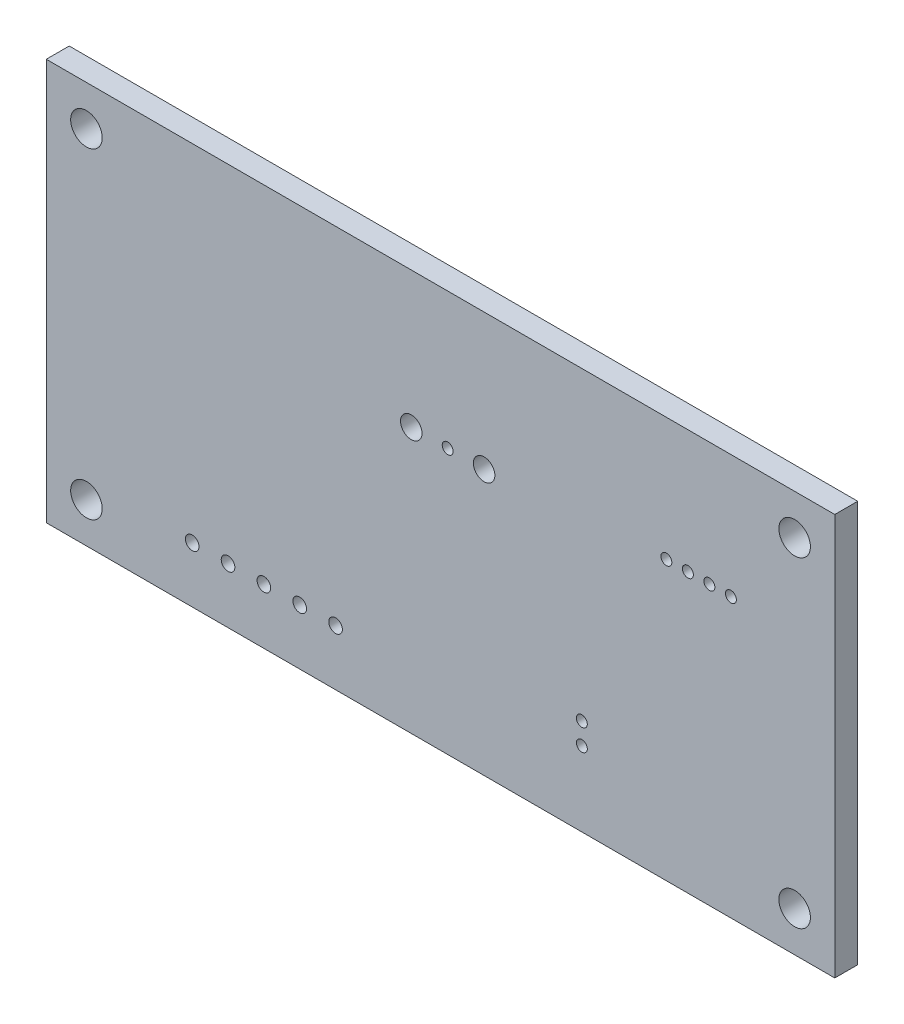
ISO-10303-21;
HEADER;
FILE_DESCRIPTION(('STEP AP214'),'2;1');
FILE_NAME('part.step','',(''),(''),'','','');
FILE_SCHEMA(('AUTOMOTIVE_DESIGN { 1 0 10303 214 1 1 1 1 }'));
ENDSEC;
DATA;
#1=APPLICATION_CONTEXT('core data for automotive mechanical design processes');
#2=APPLICATION_PROTOCOL_DEFINITION('international standard','automotive_design',2000,#1);
#3=PRODUCT_CONTEXT('',#1,'mechanical');
#4=PRODUCT('Part','Part','',(#3));
#5=PRODUCT_RELATED_PRODUCT_CATEGORY('part','',(#4));
#6=PRODUCT_DEFINITION_FORMATION('','',#4);
#7=PRODUCT_DEFINITION_CONTEXT('part definition',#1,'design');
#8=PRODUCT_DEFINITION('design','',#6,#7);
#9=PRODUCT_DEFINITION_SHAPE('','',#8);
#10=(LENGTH_UNIT() NAMED_UNIT(*) SI_UNIT(.MILLI.,.METRE.));
#11=(NAMED_UNIT(*) PLANE_ANGLE_UNIT() SI_UNIT($,.RADIAN.));
#12=(NAMED_UNIT(*) SI_UNIT($,.STERADIAN.) SOLID_ANGLE_UNIT());
#13=UNCERTAINTY_MEASURE_WITH_UNIT(LENGTH_MEASURE(1.E-05),#10,'distance_accuracy_value','');
#14=(GEOMETRIC_REPRESENTATION_CONTEXT(3) GLOBAL_UNCERTAINTY_ASSIGNED_CONTEXT((#13)) GLOBAL_UNIT_ASSIGNED_CONTEXT((#10,
#11,#12)) REPRESENTATION_CONTEXT('',''));
#15=CARTESIAN_POINT('',(0.,0.,0.));
#16=DIRECTION('',(0.,0.,1.));
#17=DIRECTION('',(1.,0.,0.));
#18=AXIS2_PLACEMENT_3D('',#15,#16,#17);
#19=CARTESIAN_POINT('',(64.754,-24.082,-0.8));
#20=DIRECTION('',(0.,0.,1.));
#21=DIRECTION('',(1.,0.,0.));
#22=AXIS2_PLACEMENT_3D('',#19,#20,#21);
#23=CYLINDRICAL_SURFACE('',#22,0.381);
#24=DIRECTION('',(0.,0.,1.));
#25=VECTOR('',#24,1.);
#26=CARTESIAN_POINT('',(65.135,-24.082,-0.8));
#27=LINE('',#26,#25);
#28=CARTESIAN_POINT('',(65.135,-24.082,0.));
#29=VERTEX_POINT('',#28);
#30=CARTESIAN_POINT('',(65.135,-24.082,1.6));
#31=VERTEX_POINT('',#30);
#32=EDGE_CURVE('E11',#29,#31,#27,.T.);
#33=ORIENTED_EDGE('',*,*,#32,.F.);
#34=CARTESIAN_POINT('',(64.754,-24.082,0.));
#35=DIRECTION('',(0.,0.,1.));
#36=DIRECTION('',(1.,0.,0.));
#37=AXIS2_PLACEMENT_3D('',#34,#35,#36);
#38=CIRCLE('',#37,0.381);
#39=EDGE_CURVE('E233',#29,#29,#38,.T.);
#40=ORIENTED_EDGE('',*,*,#39,.F.);
#41=ORIENTED_EDGE('',*,*,#32,.T.);
#42=CARTESIAN_POINT('',(64.754,-24.082,1.6));
#43=DIRECTION('',(0.,0.,1.));
#44=DIRECTION('',(1.,0.,0.));
#45=AXIS2_PLACEMENT_3D('',#42,#43,#44);
#46=CIRCLE('',#45,0.381);
#47=EDGE_CURVE('E343',#31,#31,#46,.T.);
#48=ORIENTED_EDGE('',*,*,#47,.T.);
#49=EDGE_LOOP('',(#33,#40,#41,#48));
#50=FACE_BOUND('',#49,.T.);
#51=ADVANCED_FACE('F17',(#50),#23,.F.);
#52=CARTESIAN_POINT('',(69.2,-40.7,-0.8));
#53=DIRECTION('',(0.,0.,1.));
#54=DIRECTION('',(1.,0.,0.));
#55=AXIS2_PLACEMENT_3D('',#52,#53,#54);
#56=CYLINDRICAL_SURFACE('',#55,1.1);
#57=DIRECTION('',(0.,0.,1.));
#58=VECTOR('',#57,1.);
#59=CARTESIAN_POINT('',(70.3,-40.7,-0.8));
#60=LINE('',#59,#58);
#61=CARTESIAN_POINT('',(70.3,-40.7,0.));
#62=VERTEX_POINT('',#61);
#63=CARTESIAN_POINT('',(70.3,-40.7,1.6));
#64=VERTEX_POINT('',#63);
#65=EDGE_CURVE('E28',#62,#64,#60,.T.);
#66=ORIENTED_EDGE('',*,*,#65,.F.);
#67=CARTESIAN_POINT('',(69.2,-40.7,0.));
#68=DIRECTION('',(0.,0.,1.));
#69=DIRECTION('',(1.,0.,0.));
#70=AXIS2_PLACEMENT_3D('',#67,#68,#69);
#71=CIRCLE('',#70,1.1);
#72=EDGE_CURVE('E269',#62,#62,#71,.T.);
#73=ORIENTED_EDGE('',*,*,#72,.F.);
#74=ORIENTED_EDGE('',*,*,#65,.T.);
#75=CARTESIAN_POINT('',(69.2,-40.7,1.6));
#76=DIRECTION('',(0.,0.,1.));
#77=DIRECTION('',(1.,0.,0.));
#78=AXIS2_PLACEMENT_3D('',#75,#76,#77);
#79=CIRCLE('',#78,1.1);
#80=EDGE_CURVE('E274',#64,#64,#79,.T.);
#81=ORIENTED_EDGE('',*,*,#80,.T.);
#82=EDGE_LOOP('',(#66,#73,#74,#81));
#83=FACE_BOUND('',#82,.T.);
#84=ADVANCED_FACE('F493',(#83),#56,.F.);
#85=CARTESIAN_POINT('',(69.2,-18.3,-0.8));
#86=DIRECTION('',(0.,0.,1.));
#87=DIRECTION('',(1.,0.,0.));
#88=AXIS2_PLACEMENT_3D('',#85,#86,#87);
#89=CYLINDRICAL_SURFACE('',#88,1.1);
#90=DIRECTION('',(0.,0.,1.));
#91=VECTOR('',#90,1.);
#92=CARTESIAN_POINT('',(70.3,-18.3,-0.8));
#93=LINE('',#92,#91);
#94=CARTESIAN_POINT('',(70.3,-18.3,0.));
#95=VERTEX_POINT('',#94);
#96=CARTESIAN_POINT('',(70.3,-18.3,1.6));
#97=VERTEX_POINT('',#96);
#98=EDGE_CURVE('E280',#95,#97,#93,.T.);
#99=ORIENTED_EDGE('',*,*,#98,.F.);
#100=CARTESIAN_POINT('',(69.2,-18.3,0.));
#101=DIRECTION('',(0.,0.,1.));
#102=DIRECTION('',(1.,0.,0.));
#103=AXIS2_PLACEMENT_3D('',#100,#101,#102);
#104=CIRCLE('',#103,1.1);
#105=EDGE_CURVE('E265',#95,#95,#104,.T.);
#106=ORIENTED_EDGE('',*,*,#105,.F.);
#107=ORIENTED_EDGE('',*,*,#98,.T.);
#108=CARTESIAN_POINT('',(69.2,-18.3,1.6));
#109=DIRECTION('',(0.,0.,1.));
#110=DIRECTION('',(1.,0.,0.));
#111=AXIS2_PLACEMENT_3D('',#108,#109,#110);
#112=CIRCLE('',#111,1.1);
#113=EDGE_CURVE('E401',#97,#97,#112,.T.);
#114=ORIENTED_EDGE('',*,*,#113,.T.);
#115=EDGE_LOOP('',(#99,#106,#107,#114));
#116=FACE_BOUND('',#115,.T.);
#117=ADVANCED_FACE('F499',(#116),#89,.F.);
#118=CARTESIAN_POINT('',(54.356,-38.298,-0.8));
#119=DIRECTION('',(0.,0.,1.));
#120=DIRECTION('',(1.,0.,0.));
#121=AXIS2_PLACEMENT_3D('',#118,#119,#120);
#122=CYLINDRICAL_SURFACE('',#121,0.381);
#123=DIRECTION('',(0.,0.,1.));
#124=VECTOR('',#123,1.);
#125=CARTESIAN_POINT('',(54.737,-38.298,-0.8));
#126=LINE('',#125,#124);
#127=CARTESIAN_POINT('',(54.737,-38.298,0.));
#128=VERTEX_POINT('',#127);
#129=CARTESIAN_POINT('',(54.737,-38.298,1.6));
#130=VERTEX_POINT('',#129);
#131=EDGE_CURVE('E248',#128,#130,#126,.T.);
#132=ORIENTED_EDGE('',*,*,#131,.F.);
#133=CARTESIAN_POINT('',(54.356,-38.298,0.));
#134=DIRECTION('',(0.,0.,1.));
#135=DIRECTION('',(1.,0.,0.));
#136=AXIS2_PLACEMENT_3D('',#133,#134,#135);
#137=CIRCLE('',#136,0.381);
#138=EDGE_CURVE('E270',#128,#128,#137,.T.);
#139=ORIENTED_EDGE('',*,*,#138,.F.);
#140=ORIENTED_EDGE('',*,*,#131,.T.);
#141=CARTESIAN_POINT('',(54.356,-38.298,1.6));
#142=DIRECTION('',(0.,0.,1.));
#143=DIRECTION('',(1.,0.,0.));
#144=AXIS2_PLACEMENT_3D('',#141,#142,#143);
#145=CIRCLE('',#144,0.381);
#146=EDGE_CURVE('E410',#130,#130,#145,.T.);
#147=ORIENTED_EDGE('',*,*,#146,.T.);
#148=EDGE_LOOP('',(#132,#139,#140,#147));
#149=FACE_BOUND('',#148,.T.);
#150=ADVANCED_FACE('F463',(#149),#122,.F.);
#151=CARTESIAN_POINT('',(54.356,-36.798,-0.8));
#152=DIRECTION('',(0.,0.,1.));
#153=DIRECTION('',(1.,0.,0.));
#154=AXIS2_PLACEMENT_3D('',#151,#152,#153);
#155=CYLINDRICAL_SURFACE('',#154,0.381);
#156=DIRECTION('',(0.,0.,1.));
#157=VECTOR('',#156,1.);
#158=CARTESIAN_POINT('',(54.737,-36.798,-0.8));
#159=LINE('',#158,#157);
#160=CARTESIAN_POINT('',(54.737,-36.798,0.));
#161=VERTEX_POINT('',#160);
#162=CARTESIAN_POINT('',(54.737,-36.798,1.6));
#163=VERTEX_POINT('',#162);
#164=EDGE_CURVE('E215',#161,#163,#159,.T.);
#165=ORIENTED_EDGE('',*,*,#164,.F.);
#166=CARTESIAN_POINT('',(54.356,-36.798,0.));
#167=DIRECTION('',(0.,0.,1.));
#168=DIRECTION('',(1.,0.,0.));
#169=AXIS2_PLACEMENT_3D('',#166,#167,#168);
#170=CIRCLE('',#169,0.381);
#171=EDGE_CURVE('E347',#161,#161,#170,.T.);
#172=ORIENTED_EDGE('',*,*,#171,.F.);
#173=ORIENTED_EDGE('',*,*,#164,.T.);
#174=CARTESIAN_POINT('',(54.356,-36.798,1.6));
#175=DIRECTION('',(0.,0.,1.));
#176=DIRECTION('',(1.,0.,0.));
#177=AXIS2_PLACEMENT_3D('',#174,#175,#176);
#178=CIRCLE('',#177,0.381);
#179=EDGE_CURVE('E278',#163,#163,#178,.T.);
#180=ORIENTED_EDGE('',*,*,#179,.T.);
#181=EDGE_LOOP('',(#165,#172,#173,#180));
#182=FACE_BOUND('',#181,.T.);
#183=ADVANCED_FACE('F580',(#182),#155,.F.);
#184=CARTESIAN_POINT('',(34.678,-39.624,-0.8));
#185=DIRECTION('',(0.,0.,1.));
#186=DIRECTION('',(1.,0.,0.));
#187=AXIS2_PLACEMENT_3D('',#184,#185,#186);
#188=CYLINDRICAL_SURFACE('',#187,0.475);
#189=DIRECTION('',(0.,0.,1.));
#190=VECTOR('',#189,1.);
#191=CARTESIAN_POINT('',(35.153,-39.624,-0.8));
#192=LINE('',#191,#190);
#193=CARTESIAN_POINT('',(35.153,-39.624,0.));
#194=VERTEX_POINT('',#193);
#195=CARTESIAN_POINT('',(35.153,-39.624,1.6));
#196=VERTEX_POINT('',#195);
#197=EDGE_CURVE('E211',#194,#196,#192,.T.);
#198=ORIENTED_EDGE('',*,*,#197,.F.);
#199=CARTESIAN_POINT('',(34.678,-39.624,0.));
#200=DIRECTION('',(0.,0.,1.));
#201=DIRECTION('',(1.,0.,0.));
#202=AXIS2_PLACEMENT_3D('',#199,#200,#201);
#203=CIRCLE('',#202,0.475);
#204=EDGE_CURVE('E227',#194,#194,#203,.T.);
#205=ORIENTED_EDGE('',*,*,#204,.F.);
#206=ORIENTED_EDGE('',*,*,#197,.T.);
#207=CARTESIAN_POINT('',(34.678,-39.624,1.6));
#208=DIRECTION('',(0.,0.,1.));
#209=DIRECTION('',(1.,0.,0.));
#210=AXIS2_PLACEMENT_3D('',#207,#208,#209);
#211=CIRCLE('',#210,0.475);
#212=EDGE_CURVE('E293',#196,#196,#211,.T.);
#213=ORIENTED_EDGE('',*,*,#212,.T.);
#214=EDGE_LOOP('',(#198,#205,#206,#213));
#215=FACE_BOUND('',#214,.T.);
#216=ADVANCED_FACE('F503',(#215),#188,.F.);
#217=CARTESIAN_POINT('',(37.178,-39.624,-0.8));
#218=DIRECTION('',(0.,0.,1.));
#219=DIRECTION('',(1.,0.,0.));
#220=AXIS2_PLACEMENT_3D('',#217,#218,#219);
#221=CYLINDRICAL_SURFACE('',#220,0.475);
#222=DIRECTION('',(0.,0.,1.));
#223=VECTOR('',#222,1.);
#224=CARTESIAN_POINT('',(37.653,-39.624,-0.8));
#225=LINE('',#224,#223);
#226=CARTESIAN_POINT('',(37.653,-39.624,0.));
#227=VERTEX_POINT('',#226);
#228=CARTESIAN_POINT('',(37.653,-39.624,1.6));
#229=VERTEX_POINT('',#228);
#230=EDGE_CURVE('E216',#227,#229,#225,.T.);
#231=ORIENTED_EDGE('',*,*,#230,.F.);
#232=CARTESIAN_POINT('',(37.178,-39.624,0.));
#233=DIRECTION('',(0.,0.,1.));
#234=DIRECTION('',(1.,0.,0.));
#235=AXIS2_PLACEMENT_3D('',#232,#233,#234);
#236=CIRCLE('',#235,0.475);
#237=EDGE_CURVE('E223',#227,#227,#236,.T.);
#238=ORIENTED_EDGE('',*,*,#237,.F.);
#239=ORIENTED_EDGE('',*,*,#230,.T.);
#240=CARTESIAN_POINT('',(37.178,-39.624,1.6));
#241=DIRECTION('',(0.,0.,1.));
#242=DIRECTION('',(1.,0.,0.));
#243=AXIS2_PLACEMENT_3D('',#240,#241,#242);
#244=CIRCLE('',#243,0.475);
#245=EDGE_CURVE('E210',#229,#229,#244,.T.);
#246=ORIENTED_EDGE('',*,*,#245,.T.);
#247=EDGE_LOOP('',(#231,#238,#239,#246));
#248=FACE_BOUND('',#247,.T.);
#249=ADVANCED_FACE('F602',(#248),#221,.F.);
#250=CARTESIAN_POINT('',(32.178,-39.624,-0.8));
#251=DIRECTION('',(0.,0.,1.));
#252=DIRECTION('',(1.,0.,0.));
#253=AXIS2_PLACEMENT_3D('',#250,#251,#252);
#254=CYLINDRICAL_SURFACE('',#253,0.475);
#255=DIRECTION('',(0.,0.,1.));
#256=VECTOR('',#255,1.);
#257=CARTESIAN_POINT('',(32.653,-39.624,-0.8));
#258=LINE('',#257,#256);
#259=CARTESIAN_POINT('',(32.653,-39.624,0.));
#260=VERTEX_POINT('',#259);
#261=CARTESIAN_POINT('',(32.653,-39.624,1.6));
#262=VERTEX_POINT('',#261);
#263=EDGE_CURVE('E357',#260,#262,#258,.T.);
#264=ORIENTED_EDGE('',*,*,#263,.F.);
#265=CARTESIAN_POINT('',(32.178,-39.624,0.));
#266=DIRECTION('',(0.,0.,1.));
#267=DIRECTION('',(1.,0.,0.));
#268=AXIS2_PLACEMENT_3D('',#265,#266,#267);
#269=CIRCLE('',#268,0.475);
#270=EDGE_CURVE('E228',#260,#260,#269,.T.);
#271=ORIENTED_EDGE('',*,*,#270,.F.);
#272=ORIENTED_EDGE('',*,*,#263,.T.);
#273=CARTESIAN_POINT('',(32.178,-39.624,1.6));
#274=DIRECTION('',(0.,0.,1.));
#275=DIRECTION('',(1.,0.,0.));
#276=AXIS2_PLACEMENT_3D('',#273,#274,#275);
#277=CIRCLE('',#276,0.475);
#278=EDGE_CURVE('E277',#262,#262,#277,.T.);
#279=ORIENTED_EDGE('',*,*,#278,.T.);
#280=EDGE_LOOP('',(#264,#271,#272,#279));
#281=FACE_BOUND('',#280,.T.);
#282=ADVANCED_FACE('F515',(#281),#254,.F.);
#283=CARTESIAN_POINT('',(19.8,-40.7,-0.8));
#284=DIRECTION('',(0.,0.,1.));
#285=DIRECTION('',(1.,0.,0.));
#286=AXIS2_PLACEMENT_3D('',#283,#284,#285);
#287=CYLINDRICAL_SURFACE('',#286,1.1);
#288=DIRECTION('',(0.,0.,1.));
#289=VECTOR('',#288,1.);
#290=CARTESIAN_POINT('',(20.9,-40.7,-0.8));
#291=LINE('',#290,#289);
#292=CARTESIAN_POINT('',(20.9,-40.7,0.));
#293=VERTEX_POINT('',#292);
#294=CARTESIAN_POINT('',(20.9,-40.7,1.6));
#295=VERTEX_POINT('',#294);
#296=EDGE_CURVE('E241',#293,#295,#291,.T.);
#297=ORIENTED_EDGE('',*,*,#296,.F.);
#298=CARTESIAN_POINT('',(19.8,-40.7,0.));
#299=DIRECTION('',(0.,0.,1.));
#300=DIRECTION('',(1.,0.,0.));
#301=AXIS2_PLACEMENT_3D('',#298,#299,#300);
#302=CIRCLE('',#301,1.1);
#303=EDGE_CURVE('E451',#293,#293,#302,.T.);
#304=ORIENTED_EDGE('',*,*,#303,.F.);
#305=ORIENTED_EDGE('',*,*,#296,.T.);
#306=CARTESIAN_POINT('',(19.8,-40.7,1.6));
#307=DIRECTION('',(0.,0.,1.));
#308=DIRECTION('',(1.,0.,0.));
#309=AXIS2_PLACEMENT_3D('',#306,#307,#308);
#310=CIRCLE('',#309,1.1);
#311=EDGE_CURVE('E221',#295,#295,#310,.T.);
#312=ORIENTED_EDGE('',*,*,#311,.T.);
#313=EDGE_LOOP('',(#297,#304,#305,#312));
#314=FACE_BOUND('',#313,.T.);
#315=ADVANCED_FACE('F508',(#314),#287,.F.);
#316=CARTESIAN_POINT('',(29.678,-39.624,-0.8));
#317=DIRECTION('',(0.,0.,1.));
#318=DIRECTION('',(1.,0.,0.));
#319=AXIS2_PLACEMENT_3D('',#316,#317,#318);
#320=CYLINDRICAL_SURFACE('',#319,0.475);
#321=DIRECTION('',(0.,0.,1.));
#322=VECTOR('',#321,1.);
#323=CARTESIAN_POINT('',(30.153,-39.624,-0.8));
#324=LINE('',#323,#322);
#325=CARTESIAN_POINT('',(30.153,-39.624,0.));
#326=VERTEX_POINT('',#325);
#327=CARTESIAN_POINT('',(30.153,-39.624,1.6));
#328=VERTEX_POINT('',#327);
#329=EDGE_CURVE('E42',#326,#328,#324,.T.);
#330=ORIENTED_EDGE('',*,*,#329,.F.);
#331=CARTESIAN_POINT('',(29.678,-39.624,0.));
#332=DIRECTION('',(0.,0.,1.));
#333=DIRECTION('',(1.,0.,0.));
#334=AXIS2_PLACEMENT_3D('',#331,#332,#333);
#335=CIRCLE('',#334,0.475);
#336=EDGE_CURVE('E340',#326,#326,#335,.T.);
#337=ORIENTED_EDGE('',*,*,#336,.F.);
#338=ORIENTED_EDGE('',*,*,#329,.T.);
#339=CARTESIAN_POINT('',(29.678,-39.624,1.6));
#340=DIRECTION('',(0.,0.,1.));
#341=DIRECTION('',(1.,0.,0.));
#342=AXIS2_PLACEMENT_3D('',#339,#340,#341);
#343=CIRCLE('',#342,0.475);
#344=EDGE_CURVE('E298',#328,#328,#343,.T.);
#345=ORIENTED_EDGE('',*,*,#344,.T.);
#346=EDGE_LOOP('',(#330,#337,#338,#345));
#347=FACE_BOUND('',#346,.T.);
#348=ADVANCED_FACE('F505',(#347),#320,.F.);
#349=CARTESIAN_POINT('',(27.178,-39.624,-0.8));
#350=DIRECTION('',(0.,0.,1.));
#351=DIRECTION('',(1.,0.,0.));
#352=AXIS2_PLACEMENT_3D('',#349,#350,#351);
#353=CYLINDRICAL_SURFACE('',#352,0.475);
#354=DIRECTION('',(0.,0.,1.));
#355=VECTOR('',#354,1.);
#356=CARTESIAN_POINT('',(27.653,-39.624,-0.8));
#357=LINE('',#356,#355);
#358=CARTESIAN_POINT('',(27.653,-39.624,0.));
#359=VERTEX_POINT('',#358);
#360=CARTESIAN_POINT('',(27.653,-39.624,1.6));
#361=VERTEX_POINT('',#360);
#362=EDGE_CURVE('E242',#359,#361,#357,.T.);
#363=ORIENTED_EDGE('',*,*,#362,.F.);
#364=CARTESIAN_POINT('',(27.178,-39.624,0.));
#365=DIRECTION('',(0.,0.,1.));
#366=DIRECTION('',(1.,0.,0.));
#367=AXIS2_PLACEMENT_3D('',#364,#365,#366);
#368=CIRCLE('',#367,0.475);
#369=EDGE_CURVE('E257',#359,#359,#368,.T.);
#370=ORIENTED_EDGE('',*,*,#369,.F.);
#371=ORIENTED_EDGE('',*,*,#362,.T.);
#372=CARTESIAN_POINT('',(27.178,-39.624,1.6));
#373=DIRECTION('',(0.,0.,1.));
#374=DIRECTION('',(1.,0.,0.));
#375=AXIS2_PLACEMENT_3D('',#372,#373,#374);
#376=CIRCLE('',#375,0.475);
#377=EDGE_CURVE('E217',#361,#361,#376,.T.);
#378=ORIENTED_EDGE('',*,*,#377,.T.);
#379=EDGE_LOOP('',(#363,#370,#371,#378));
#380=FACE_BOUND('',#379,.T.);
#381=ADVANCED_FACE('F507',(#380),#353,.F.);
#382=CARTESIAN_POINT('',(19.8,-18.3,-0.8));
#383=DIRECTION('',(0.,0.,1.));
#384=DIRECTION('',(1.,0.,0.));
#385=AXIS2_PLACEMENT_3D('',#382,#383,#384);
#386=CYLINDRICAL_SURFACE('',#385,1.1);
#387=DIRECTION('',(0.,0.,1.));
#388=VECTOR('',#387,1.);
#389=CARTESIAN_POINT('',(20.9,-18.3,-0.8));
#390=LINE('',#389,#388);
#391=CARTESIAN_POINT('',(20.9,-18.3,0.));
#392=VERTEX_POINT('',#391);
#393=CARTESIAN_POINT('',(20.9,-18.3,1.6));
#394=VERTEX_POINT('',#393);
#395=EDGE_CURVE('E264',#392,#394,#390,.T.);
#396=ORIENTED_EDGE('',*,*,#395,.F.);
#397=CARTESIAN_POINT('',(19.8,-18.3,0.));
#398=DIRECTION('',(0.,0.,1.));
#399=DIRECTION('',(1.,0.,0.));
#400=AXIS2_PLACEMENT_3D('',#397,#398,#399);
#401=CIRCLE('',#400,1.1);
#402=EDGE_CURVE('E253',#392,#392,#401,.T.);
#403=ORIENTED_EDGE('',*,*,#402,.F.);
#404=ORIENTED_EDGE('',*,*,#395,.T.);
#405=CARTESIAN_POINT('',(19.8,-18.3,1.6));
#406=DIRECTION('',(0.,0.,1.));
#407=DIRECTION('',(1.,0.,0.));
#408=AXIS2_PLACEMENT_3D('',#405,#406,#407);
#409=CIRCLE('',#408,1.1);
#410=EDGE_CURVE('E222',#394,#394,#409,.T.);
#411=ORIENTED_EDGE('',*,*,#410,.T.);
#412=EDGE_LOOP('',(#396,#403,#404,#411));
#413=FACE_BOUND('',#412,.T.);
#414=ADVANCED_FACE('F19',(#413),#386,.F.);
#415=CARTESIAN_POINT('',(42.46,-25.,-0.8));
#416=DIRECTION('',(0.,0.,1.));
#417=DIRECTION('',(1.,0.,0.));
#418=AXIS2_PLACEMENT_3D('',#415,#416,#417);
#419=CYLINDRICAL_SURFACE('',#418,0.75);
#420=DIRECTION('',(0.,0.,1.));
#421=VECTOR('',#420,1.);
#422=CARTESIAN_POINT('',(43.21,-25.,-0.8));
#423=LINE('',#422,#421);
#424=CARTESIAN_POINT('',(43.21,-25.,0.));
#425=VERTEX_POINT('',#424);
#426=CARTESIAN_POINT('',(43.21,-25.,1.6));
#427=VERTEX_POINT('',#426);
#428=EDGE_CURVE('E188',#425,#427,#423,.T.);
#429=ORIENTED_EDGE('',*,*,#428,.F.);
#430=CARTESIAN_POINT('',(42.46,-25.,0.));
#431=DIRECTION('',(0.,0.,1.));
#432=DIRECTION('',(1.,0.,0.));
#433=AXIS2_PLACEMENT_3D('',#430,#431,#432);
#434=CIRCLE('',#433,0.75);
#435=EDGE_CURVE('E258',#425,#425,#434,.T.);
#436=ORIENTED_EDGE('',*,*,#435,.F.);
#437=ORIENTED_EDGE('',*,*,#428,.T.);
#438=CARTESIAN_POINT('',(42.46,-25.,1.6));
#439=DIRECTION('',(0.,0.,1.));
#440=DIRECTION('',(1.,0.,0.));
#441=AXIS2_PLACEMENT_3D('',#438,#439,#440);
#442=CIRCLE('',#441,0.75);
#443=EDGE_CURVE('E398',#427,#427,#442,.T.);
#444=ORIENTED_EDGE('',*,*,#443,.T.);
#445=EDGE_LOOP('',(#429,#436,#437,#444));
#446=FACE_BOUND('',#445,.T.);
#447=ADVANCED_FACE('F474',(#446),#419,.F.);
#448=CARTESIAN_POINT('',(45.,-25.,-0.8));
#449=DIRECTION('',(0.,0.,1.));
#450=DIRECTION('',(1.,0.,0.));
#451=AXIS2_PLACEMENT_3D('',#448,#449,#450);
#452=CYLINDRICAL_SURFACE('',#451,0.381);
#453=DIRECTION('',(0.,0.,1.));
#454=VECTOR('',#453,1.);
#455=CARTESIAN_POINT('',(45.381,-25.,-0.8));
#456=LINE('',#455,#454);
#457=CARTESIAN_POINT('',(45.381,-25.,0.));
#458=VERTEX_POINT('',#457);
#459=CARTESIAN_POINT('',(45.381,-25.,1.6));
#460=VERTEX_POINT('',#459);
#461=EDGE_CURVE('E181',#458,#460,#456,.T.);
#462=ORIENTED_EDGE('',*,*,#461,.F.);
#463=CARTESIAN_POINT('',(45.,-25.,0.));
#464=DIRECTION('',(0.,0.,1.));
#465=DIRECTION('',(1.,0.,0.));
#466=AXIS2_PLACEMENT_3D('',#463,#464,#465);
#467=CIRCLE('',#466,0.381);
#468=EDGE_CURVE('E251',#458,#458,#467,.T.);
#469=ORIENTED_EDGE('',*,*,#468,.F.);
#470=ORIENTED_EDGE('',*,*,#461,.T.);
#471=CARTESIAN_POINT('',(45.,-25.,1.6));
#472=DIRECTION('',(0.,0.,1.));
#473=DIRECTION('',(1.,0.,0.));
#474=AXIS2_PLACEMENT_3D('',#471,#472,#473);
#475=CIRCLE('',#474,0.381);
#476=EDGE_CURVE('E209',#460,#460,#475,.T.);
#477=ORIENTED_EDGE('',*,*,#476,.T.);
#478=EDGE_LOOP('',(#462,#469,#470,#477));
#479=FACE_BOUND('',#478,.T.);
#480=ADVANCED_FACE('F433',(#479),#452,.F.);
#481=CARTESIAN_POINT('',(47.54,-25.,-0.8));
#482=DIRECTION('',(0.,0.,1.));
#483=DIRECTION('',(1.,0.,0.));
#484=AXIS2_PLACEMENT_3D('',#481,#482,#483);
#485=CYLINDRICAL_SURFACE('',#484,0.75);
#486=DIRECTION('',(0.,0.,1.));
#487=VECTOR('',#486,1.);
#488=CARTESIAN_POINT('',(48.29,-25.,-0.8));
#489=LINE('',#488,#487);
#490=CARTESIAN_POINT('',(48.29,-25.,0.));
#491=VERTEX_POINT('',#490);
#492=CARTESIAN_POINT('',(48.29,-25.,1.6));
#493=VERTEX_POINT('',#492);
#494=EDGE_CURVE('E174',#491,#493,#489,.T.);
#495=ORIENTED_EDGE('',*,*,#494,.F.);
#496=CARTESIAN_POINT('',(47.54,-25.,0.));
#497=DIRECTION('',(0.,0.,1.));
#498=DIRECTION('',(1.,0.,0.));
#499=AXIS2_PLACEMENT_3D('',#496,#497,#498);
#500=CIRCLE('',#499,0.75);
#501=EDGE_CURVE('E179',#491,#491,#500,.T.);
#502=ORIENTED_EDGE('',*,*,#501,.F.);
#503=ORIENTED_EDGE('',*,*,#494,.T.);
#504=CARTESIAN_POINT('',(47.54,-25.,1.6));
#505=DIRECTION('',(0.,0.,1.));
#506=DIRECTION('',(1.,0.,0.));
#507=AXIS2_PLACEMENT_3D('',#504,#505,#506);
#508=CIRCLE('',#507,0.75);
#509=EDGE_CURVE('E177',#493,#493,#508,.T.);
#510=ORIENTED_EDGE('',*,*,#509,.T.);
#511=EDGE_LOOP('',(#495,#502,#503,#510));
#512=FACE_BOUND('',#511,.T.);
#513=ADVANCED_FACE('F175',(#512),#485,.F.);
#514=CARTESIAN_POINT('',(60.254,-24.082,-0.8));
#515=DIRECTION('',(0.,0.,1.));
#516=DIRECTION('',(1.,0.,0.));
#517=AXIS2_PLACEMENT_3D('',#514,#515,#516);
#518=CYLINDRICAL_SURFACE('',#517,0.381);
#519=DIRECTION('',(0.,0.,1.));
#520=VECTOR('',#519,1.);
#521=CARTESIAN_POINT('',(60.635,-24.082,-0.8));
#522=LINE('',#521,#520);
#523=CARTESIAN_POINT('',(60.635,-24.082,0.));
#524=VERTEX_POINT('',#523);
#525=CARTESIAN_POINT('',(60.635,-24.082,1.6));
#526=VERTEX_POINT('',#525);
#527=EDGE_CURVE('E182',#524,#526,#522,.T.);
#528=ORIENTED_EDGE('',*,*,#527,.F.);
#529=CARTESIAN_POINT('',(60.254,-24.082,0.));
#530=DIRECTION('',(0.,0.,1.));
#531=DIRECTION('',(1.,0.,0.));
#532=AXIS2_PLACEMENT_3D('',#529,#530,#531);
#533=CIRCLE('',#532,0.381);
#534=EDGE_CURVE('E252',#524,#524,#533,.T.);
#535=ORIENTED_EDGE('',*,*,#534,.F.);
#536=ORIENTED_EDGE('',*,*,#527,.T.);
#537=CARTESIAN_POINT('',(60.254,-24.082,1.6));
#538=DIRECTION('',(0.,0.,1.));
#539=DIRECTION('',(1.,0.,0.));
#540=AXIS2_PLACEMENT_3D('',#537,#538,#539);
#541=CIRCLE('',#540,0.381);
#542=EDGE_CURVE('E404',#526,#526,#541,.T.);
#543=ORIENTED_EDGE('',*,*,#542,.T.);
#544=EDGE_LOOP('',(#528,#535,#536,#543));
#545=FACE_BOUND('',#544,.T.);
#546=ADVANCED_FACE('F583',(#545),#518,.F.);
#547=CARTESIAN_POINT('',(61.754,-24.082,-0.8));
#548=DIRECTION('',(0.,0.,1.));
#549=DIRECTION('',(1.,0.,0.));
#550=AXIS2_PLACEMENT_3D('',#547,#548,#549);
#551=CYLINDRICAL_SURFACE('',#550,0.381);
#552=DIRECTION('',(0.,0.,1.));
#553=VECTOR('',#552,1.);
#554=CARTESIAN_POINT('',(62.135,-24.082,-0.8));
#555=LINE('',#554,#553);
#556=CARTESIAN_POINT('',(62.135,-24.082,0.));
#557=VERTEX_POINT('',#556);
#558=CARTESIAN_POINT('',(62.135,-24.082,1.6));
#559=VERTEX_POINT('',#558);
#560=EDGE_CURVE('E190',#557,#559,#555,.T.);
#561=ORIENTED_EDGE('',*,*,#560,.F.);
#562=CARTESIAN_POINT('',(61.754,-24.082,0.));
#563=DIRECTION('',(0.,0.,1.));
#564=DIRECTION('',(1.,0.,0.));
#565=AXIS2_PLACEMENT_3D('',#562,#563,#564);
#566=CIRCLE('',#565,0.381);
#567=EDGE_CURVE('E332',#557,#557,#566,.T.);
#568=ORIENTED_EDGE('',*,*,#567,.F.);
#569=ORIENTED_EDGE('',*,*,#560,.T.);
#570=CARTESIAN_POINT('',(61.754,-24.082,1.6));
#571=DIRECTION('',(0.,0.,1.));
#572=DIRECTION('',(1.,0.,0.));
#573=AXIS2_PLACEMENT_3D('',#570,#571,#572);
#574=CIRCLE('',#573,0.381);
#575=EDGE_CURVE('E232',#559,#559,#574,.T.);
#576=ORIENTED_EDGE('',*,*,#575,.T.);
#577=EDGE_LOOP('',(#561,#568,#569,#576));
#578=FACE_BOUND('',#577,.T.);
#579=ADVANCED_FACE('F557',(#578),#551,.F.);
#580=CARTESIAN_POINT('',(63.254,-24.082,-0.8));
#581=DIRECTION('',(0.,0.,1.));
#582=DIRECTION('',(1.,0.,0.));
#583=AXIS2_PLACEMENT_3D('',#580,#581,#582);
#584=CYLINDRICAL_SURFACE('',#583,0.381);
#585=DIRECTION('',(0.,0.,1.));
#586=VECTOR('',#585,1.);
#587=CARTESIAN_POINT('',(63.635,-24.082,-0.8));
#588=LINE('',#587,#586);
#589=CARTESIAN_POINT('',(63.635,-24.082,0.));
#590=VERTEX_POINT('',#589);
#591=CARTESIAN_POINT('',(63.635,-24.082,1.6));
#592=VERTEX_POINT('',#591);
#593=EDGE_CURVE('E193',#590,#592,#588,.T.);
#594=ORIENTED_EDGE('',*,*,#593,.F.);
#595=CARTESIAN_POINT('',(63.254,-24.082,0.));
#596=DIRECTION('',(0.,0.,1.));
#597=DIRECTION('',(1.,0.,0.));
#598=AXIS2_PLACEMENT_3D('',#595,#596,#597);
#599=CIRCLE('',#598,0.381);
#600=EDGE_CURVE('E199',#590,#590,#599,.T.);
#601=ORIENTED_EDGE('',*,*,#600,.F.);
#602=ORIENTED_EDGE('',*,*,#593,.T.);
#603=CARTESIAN_POINT('',(63.254,-24.082,1.6));
#604=DIRECTION('',(0.,0.,1.));
#605=DIRECTION('',(1.,0.,0.));
#606=AXIS2_PLACEMENT_3D('',#603,#604,#605);
#607=CIRCLE('',#606,0.381);
#608=EDGE_CURVE('E324',#592,#592,#607,.T.);
#609=ORIENTED_EDGE('',*,*,#608,.T.);
#610=EDGE_LOOP('',(#594,#601,#602,#609));
#611=FACE_BOUND('',#610,.T.);
#612=ADVANCED_FACE('F322',(#611),#584,.F.);
#613=CARTESIAN_POINT('',(72.,-43.5,0.));
#614=DIRECTION('',(-1.,0.,0.));
#615=DIRECTION('',(0.,0.,1.));
#616=AXIS2_PLACEMENT_3D('',#613,#614,#615);
#617=PLANE('',#616);
#618=DIRECTION('',(0.,1.,0.));
#619=VECTOR('',#618,1.);
#620=CARTESIAN_POINT('',(72.,-43.5,0.));
#621=LINE('',#620,#619);
#622=CARTESIAN_POINT('',(72.,-43.5,0.));
#623=VERTEX_POINT('',#622);
#624=CARTESIAN_POINT('',(72.,-15.5,0.));
#625=VERTEX_POINT('',#624);
#626=EDGE_CURVE('E196',#623,#625,#621,.T.);
#627=ORIENTED_EDGE('',*,*,#626,.T.);
#628=DIRECTION('',(0.,0.,1.));
#629=VECTOR('',#628,1.);
#630=CARTESIAN_POINT('',(72.,-15.5,0.));
#631=LINE('',#630,#629);
#632=CARTESIAN_POINT('',(72.,-15.5,1.6));
#633=VERTEX_POINT('',#632);
#634=EDGE_CURVE('E206',#625,#633,#631,.T.);
#635=ORIENTED_EDGE('',*,*,#634,.T.);
#636=DIRECTION('',(0.,1.,0.));
#637=VECTOR('',#636,1.);
#638=CARTESIAN_POINT('',(72.,-43.5,1.6));
#639=LINE('',#638,#637);
#640=CARTESIAN_POINT('',(72.,-43.5,1.6));
#641=VERTEX_POINT('',#640);
#642=EDGE_CURVE('E229',#641,#633,#639,.T.);
#643=ORIENTED_EDGE('',*,*,#642,.F.);
#644=DIRECTION('',(0.,0.,1.));
#645=VECTOR('',#644,1.);
#646=CARTESIAN_POINT('',(72.,-43.5,0.));
#647=LINE('',#646,#645);
#648=EDGE_CURVE('E205',#623,#641,#647,.T.);
#649=ORIENTED_EDGE('',*,*,#648,.F.);
#650=EDGE_LOOP('',(#627,#635,#643,#649));
#651=FACE_BOUND('',#650,.T.);
#652=ADVANCED_FACE('F486',(#651),#617,.F.);
#653=CARTESIAN_POINT('',(44.5,-29.5,1.6));
#654=DIRECTION('',(0.,0.,1.));
#655=DIRECTION('',(1.,0.,0.));
#656=AXIS2_PLACEMENT_3D('',#653,#654,#655);
#657=PLANE('',#656);
#658=ORIENTED_EDGE('',*,*,#344,.F.);
#659=EDGE_LOOP('',(#658));
#660=FACE_BOUND('',#659,.T.);
#661=ORIENTED_EDGE('',*,*,#311,.F.);
#662=EDGE_LOOP('',(#661));
#663=FACE_BOUND('',#662,.T.);
#664=ORIENTED_EDGE('',*,*,#377,.F.);
#665=EDGE_LOOP('',(#664));
#666=FACE_BOUND('',#665,.T.);
#667=ORIENTED_EDGE('',*,*,#410,.F.);
#668=EDGE_LOOP('',(#667));
#669=FACE_BOUND('',#668,.T.);
#670=ORIENTED_EDGE('',*,*,#443,.F.);
#671=EDGE_LOOP('',(#670));
#672=FACE_BOUND('',#671,.T.);
#673=ORIENTED_EDGE('',*,*,#476,.F.);
#674=EDGE_LOOP('',(#673));
#675=FACE_BOUND('',#674,.T.);
#676=ORIENTED_EDGE('',*,*,#509,.F.);
#677=EDGE_LOOP('',(#676));
#678=FACE_BOUND('',#677,.T.);
#679=ORIENTED_EDGE('',*,*,#245,.F.);
#680=EDGE_LOOP('',(#679));
#681=FACE_BOUND('',#680,.T.);
#682=ORIENTED_EDGE('',*,*,#212,.F.);
#683=EDGE_LOOP('',(#682));
#684=FACE_BOUND('',#683,.T.);
#685=ORIENTED_EDGE('',*,*,#278,.F.);
#686=EDGE_LOOP('',(#685));
#687=FACE_BOUND('',#686,.T.);
#688=ORIENTED_EDGE('',*,*,#80,.F.);
#689=EDGE_LOOP('',(#688));
#690=FACE_BOUND('',#689,.T.);
#691=ORIENTED_EDGE('',*,*,#179,.F.);
#692=EDGE_LOOP('',(#691));
#693=FACE_BOUND('',#692,.T.);
#694=ORIENTED_EDGE('',*,*,#146,.F.);
#695=EDGE_LOOP('',(#694));
#696=FACE_BOUND('',#695,.T.);
#697=ORIENTED_EDGE('',*,*,#542,.F.);
#698=EDGE_LOOP('',(#697));
#699=FACE_BOUND('',#698,.T.);
#700=ORIENTED_EDGE('',*,*,#113,.F.);
#701=EDGE_LOOP('',(#700));
#702=FACE_BOUND('',#701,.T.);
#703=ORIENTED_EDGE('',*,*,#608,.F.);
#704=EDGE_LOOP('',(#703));
#705=FACE_BOUND('',#704,.T.);
#706=ORIENTED_EDGE('',*,*,#47,.F.);
#707=EDGE_LOOP('',(#706));
#708=FACE_BOUND('',#707,.T.);
#709=ORIENTED_EDGE('',*,*,#575,.F.);
#710=EDGE_LOOP('',(#709));
#711=FACE_BOUND('',#710,.T.);
#712=DIRECTION('',(0.,-1.,0.));
#713=VECTOR('',#712,1.);
#714=CARTESIAN_POINT('',(17.,-15.5,1.6));
#715=LINE('',#714,#713);
#716=CARTESIAN_POINT('',(17.,-15.5,1.6));
#717=VERTEX_POINT('',#716);
#718=CARTESIAN_POINT('',(17.,-43.5,1.6));
#719=VERTEX_POINT('',#718);
#720=EDGE_CURVE('E234',#717,#719,#715,.T.);
#721=ORIENTED_EDGE('',*,*,#720,.T.);
#722=DIRECTION('',(1.,0.,0.));
#723=VECTOR('',#722,1.);
#724=CARTESIAN_POINT('',(17.,-43.5,1.6));
#725=LINE('',#724,#723);
#726=EDGE_CURVE('E200',#719,#641,#725,.T.);
#727=ORIENTED_EDGE('',*,*,#726,.T.);
#728=ORIENTED_EDGE('',*,*,#642,.T.);
#729=DIRECTION('',(-1.,0.,0.));
#730=VECTOR('',#729,1.);
#731=CARTESIAN_POINT('',(72.,-15.5,1.6));
#732=LINE('',#731,#730);
#733=EDGE_CURVE('E287',#633,#717,#732,.T.);
#734=ORIENTED_EDGE('',*,*,#733,.T.);
#735=EDGE_LOOP('',(#721,#727,#728,#734));
#736=FACE_BOUND('',#735,.T.);
#737=ADVANCED_FACE('F376',(#660,#663,#666,#669,#672,#675,#678,#681,#684,#687,#690,#693,#696,
#699,#702,#705,#708,#711,#736),#657,.T.);
#738=CARTESIAN_POINT('',(44.5,-29.5,0.));
#739=DIRECTION('',(0.,0.,1.));
#740=DIRECTION('',(1.,0.,0.));
#741=AXIS2_PLACEMENT_3D('',#738,#739,#740);
#742=PLANE('',#741);
#743=ORIENTED_EDGE('',*,*,#39,.T.);
#744=EDGE_LOOP('',(#743));
#745=FACE_BOUND('',#744,.T.);
#746=ORIENTED_EDGE('',*,*,#72,.T.);
#747=EDGE_LOOP('',(#746));
#748=FACE_BOUND('',#747,.T.);
#749=ORIENTED_EDGE('',*,*,#105,.T.);
#750=EDGE_LOOP('',(#749));
#751=FACE_BOUND('',#750,.T.);
#752=ORIENTED_EDGE('',*,*,#138,.T.);
#753=EDGE_LOOP('',(#752));
#754=FACE_BOUND('',#753,.T.);
#755=ORIENTED_EDGE('',*,*,#171,.T.);
#756=EDGE_LOOP('',(#755));
#757=FACE_BOUND('',#756,.T.);
#758=ORIENTED_EDGE('',*,*,#204,.T.);
#759=EDGE_LOOP('',(#758));
#760=FACE_BOUND('',#759,.T.);
#761=ORIENTED_EDGE('',*,*,#237,.T.);
#762=EDGE_LOOP('',(#761));
#763=FACE_BOUND('',#762,.T.);
#764=ORIENTED_EDGE('',*,*,#270,.T.);
#765=EDGE_LOOP('',(#764));
#766=FACE_BOUND('',#765,.T.);
#767=ORIENTED_EDGE('',*,*,#303,.T.);
#768=EDGE_LOOP('',(#767));
#769=FACE_BOUND('',#768,.T.);
#770=ORIENTED_EDGE('',*,*,#336,.T.);
#771=EDGE_LOOP('',(#770));
#772=FACE_BOUND('',#771,.T.);
#773=ORIENTED_EDGE('',*,*,#369,.T.);
#774=EDGE_LOOP('',(#773));
#775=FACE_BOUND('',#774,.T.);
#776=ORIENTED_EDGE('',*,*,#402,.T.);
#777=EDGE_LOOP('',(#776));
#778=FACE_BOUND('',#777,.T.);
#779=ORIENTED_EDGE('',*,*,#435,.T.);
#780=EDGE_LOOP('',(#779));
#781=FACE_BOUND('',#780,.T.);
#782=ORIENTED_EDGE('',*,*,#468,.T.);
#783=EDGE_LOOP('',(#782));
#784=FACE_BOUND('',#783,.T.);
#785=ORIENTED_EDGE('',*,*,#501,.T.);
#786=EDGE_LOOP('',(#785));
#787=FACE_BOUND('',#786,.T.);
#788=ORIENTED_EDGE('',*,*,#534,.T.);
#789=EDGE_LOOP('',(#788));
#790=FACE_BOUND('',#789,.T.);
#791=ORIENTED_EDGE('',*,*,#567,.T.);
#792=EDGE_LOOP('',(#791));
#793=FACE_BOUND('',#792,.T.);
#794=ORIENTED_EDGE('',*,*,#600,.T.);
#795=EDGE_LOOP('',(#794));
#796=FACE_BOUND('',#795,.T.);
#797=DIRECTION('',(-1.,0.,0.));
#798=VECTOR('',#797,1.);
#799=CARTESIAN_POINT('',(72.,-15.5,0.));
#800=LINE('',#799,#798);
#801=CARTESIAN_POINT('',(17.,-15.5,0.));
#802=VERTEX_POINT('',#801);
#803=EDGE_CURVE('E382',#625,#802,#800,.T.);
#804=ORIENTED_EDGE('',*,*,#803,.F.);
#805=ORIENTED_EDGE('',*,*,#626,.F.);
#806=DIRECTION('',(1.,0.,0.));
#807=VECTOR('',#806,1.);
#808=CARTESIAN_POINT('',(17.,-43.5,0.));
#809=LINE('',#808,#807);
#810=CARTESIAN_POINT('',(17.,-43.5,0.));
#811=VERTEX_POINT('',#810);
#812=EDGE_CURVE('E201',#811,#623,#809,.T.);
#813=ORIENTED_EDGE('',*,*,#812,.F.);
#814=DIRECTION('',(0.,-1.,0.));
#815=VECTOR('',#814,1.);
#816=CARTESIAN_POINT('',(17.,-15.5,0.));
#817=LINE('',#816,#815);
#818=EDGE_CURVE('E294',#802,#811,#817,.T.);
#819=ORIENTED_EDGE('',*,*,#818,.F.);
#820=EDGE_LOOP('',(#804,#805,#813,#819));
#821=FACE_BOUND('',#820,.T.);
#822=ADVANCED_FACE('F329',(#745,#748,#751,#754,#757,#760,#763,#766,#769,#772,#775,#778,#781,
#784,#787,#790,#793,#796,#821),#742,.F.);
#823=CARTESIAN_POINT('',(17.,-43.5,0.));
#824=DIRECTION('',(0.,1.,0.));
#825=DIRECTION('',(1.,0.,0.));
#826=AXIS2_PLACEMENT_3D('',#823,#824,#825);
#827=PLANE('',#826);
#828=ORIENTED_EDGE('',*,*,#812,.T.);
#829=ORIENTED_EDGE('',*,*,#648,.T.);
#830=ORIENTED_EDGE('',*,*,#726,.F.);
#831=DIRECTION('',(0.,0.,1.));
#832=VECTOR('',#831,1.);
#833=CARTESIAN_POINT('',(17.,-43.5,0.));
#834=LINE('',#833,#832);
#835=EDGE_CURVE('E238',#811,#719,#834,.T.);
#836=ORIENTED_EDGE('',*,*,#835,.F.);
#837=EDGE_LOOP('',(#828,#829,#830,#836));
#838=FACE_BOUND('',#837,.T.);
#839=ADVANCED_FACE('F373',(#838),#827,.F.);
#840=CARTESIAN_POINT('',(72.,-15.5,0.));
#841=DIRECTION('',(0.,-1.,0.));
#842=DIRECTION('',(0.,0.,-1.));
#843=AXIS2_PLACEMENT_3D('',#840,#841,#842);
#844=PLANE('',#843);
#845=ORIENTED_EDGE('',*,*,#803,.T.);
#846=DIRECTION('',(0.,0.,1.));
#847=VECTOR('',#846,1.);
#848=CARTESIAN_POINT('',(17.,-15.5,0.));
#849=LINE('',#848,#847);
#850=EDGE_CURVE('E21',#802,#717,#849,.T.);
#851=ORIENTED_EDGE('',*,*,#850,.T.);
#852=ORIENTED_EDGE('',*,*,#733,.F.);
#853=ORIENTED_EDGE('',*,*,#634,.F.);
#854=EDGE_LOOP('',(#845,#851,#852,#853));
#855=FACE_BOUND('',#854,.T.);
#856=ADVANCED_FACE('F384',(#855),#844,.F.);
#857=CARTESIAN_POINT('',(17.,-15.5,0.));
#858=DIRECTION('',(1.,0.,0.));
#859=DIRECTION('',(0.,1.,0.));
#860=AXIS2_PLACEMENT_3D('',#857,#858,#859);
#861=PLANE('',#860);
#862=ORIENTED_EDGE('',*,*,#818,.T.);
#863=ORIENTED_EDGE('',*,*,#835,.T.);
#864=ORIENTED_EDGE('',*,*,#720,.F.);
#865=ORIENTED_EDGE('',*,*,#850,.F.);
#866=EDGE_LOOP('',(#862,#863,#864,#865));
#867=FACE_BOUND('',#866,.T.);
#868=ADVANCED_FACE('F366',(#867),#861,.F.);
#869=CLOSED_SHELL('',(#51,#84,#117,#150,#183,#216,#249,#282,#315,#348,#381,#414,#447,#480,#513,
#546,#579,#612,#652,#737,#822,#839,#856,#868));
#870=MANIFOLD_SOLID_BREP('B1',#869);
#871=ADVANCED_BREP_SHAPE_REPRESENTATION('',(#18,#870),#14);
#872=SHAPE_DEFINITION_REPRESENTATION(#9,#871);
ENDSEC;
END-ISO-10303-21;
